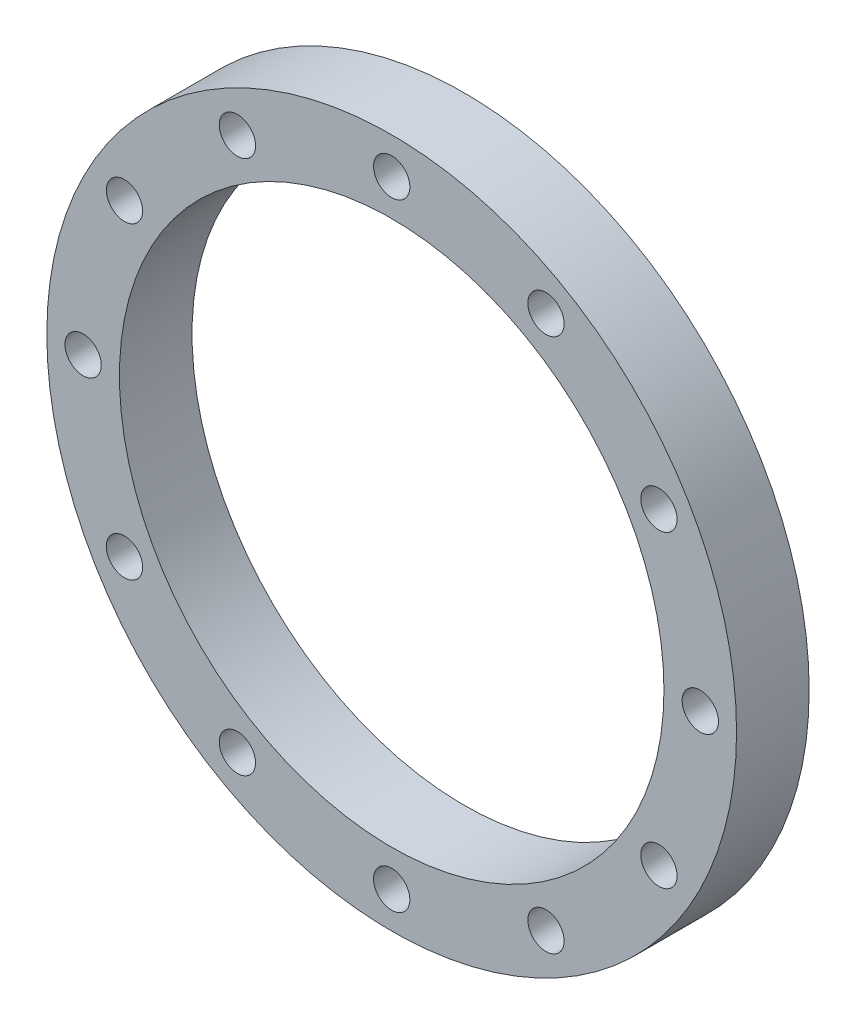
ISO-10303-21;
HEADER;
FILE_DESCRIPTION(('STEP AP214'),'2;1');
FILE_NAME('part.step','',(''),(''),'','','');
FILE_SCHEMA(('AUTOMOTIVE_DESIGN { 1 0 10303 214 1 1 1 1 }'));
ENDSEC;
DATA;
#1=APPLICATION_CONTEXT('core data for automotive mechanical design processes');
#2=APPLICATION_PROTOCOL_DEFINITION('international standard','automotive_design',2000,#1);
#3=PRODUCT_CONTEXT('',#1,'mechanical');
#4=PRODUCT('Part','Part','',(#3));
#5=PRODUCT_RELATED_PRODUCT_CATEGORY('part','',(#4));
#6=PRODUCT_DEFINITION_FORMATION('','',#4);
#7=PRODUCT_DEFINITION_CONTEXT('part definition',#1,'design');
#8=PRODUCT_DEFINITION('design','',#6,#7);
#9=PRODUCT_DEFINITION_SHAPE('','',#8);
#10=(LENGTH_UNIT() NAMED_UNIT(*) SI_UNIT(.MILLI.,.METRE.));
#11=(NAMED_UNIT(*) PLANE_ANGLE_UNIT() SI_UNIT($,.RADIAN.));
#12=(NAMED_UNIT(*) SI_UNIT($,.STERADIAN.) SOLID_ANGLE_UNIT());
#13=UNCERTAINTY_MEASURE_WITH_UNIT(LENGTH_MEASURE(1.E-05),#10,'distance_accuracy_value','');
#14=(GEOMETRIC_REPRESENTATION_CONTEXT(3) GLOBAL_UNCERTAINTY_ASSIGNED_CONTEXT((#13)) GLOBAL_UNIT_ASSIGNED_CONTEXT((#10,
#11,#12)) REPRESENTATION_CONTEXT('',''));
#15=CARTESIAN_POINT('',(0.,0.,0.));
#16=DIRECTION('',(0.,0.,1.));
#17=DIRECTION('',(1.,0.,0.));
#18=AXIS2_PLACEMENT_3D('',#15,#16,#17);
#19=CARTESIAN_POINT('',(0.,0.,25.4));
#20=DIRECTION('',(0.,0.,1.));
#21=DIRECTION('',(1.,0.,0.));
#22=AXIS2_PLACEMENT_3D('',#19,#20,#21);
#23=PLANE('',#22);
#24=CARTESIAN_POINT('',(186.974884677062,-107.949999999998,25.4));
#25=DIRECTION('',(0.,0.,1.));
#26=DIRECTION('',(1.,0.,0.));
#27=AXIS2_PLACEMENT_3D('',#24,#25,#26);
#28=CIRCLE('',#27,12.7);
#29=CARTESIAN_POINT('',(199.674884677062,-107.949999999998,25.4));
#30=VERTEX_POINT('',#29);
#31=EDGE_CURVE('E153',#30,#30,#28,.T.);
#32=ORIENTED_EDGE('',*,*,#31,.F.);
#33=EDGE_LOOP('',(#32));
#34=FACE_BOUND('',#33,.T.);
#35=CARTESIAN_POINT('',(107.950000000002,-186.974884677059,25.4));
#36=DIRECTION('',(0.,0.,1.));
#37=DIRECTION('',(1.,0.,0.));
#38=AXIS2_PLACEMENT_3D('',#35,#36,#37);
#39=CIRCLE('',#38,12.7);
#40=CARTESIAN_POINT('',(120.650000000002,-186.974884677059,25.4));
#41=VERTEX_POINT('',#40);
#42=EDGE_CURVE('E145',#41,#41,#39,.T.);
#43=ORIENTED_EDGE('',*,*,#42,.F.);
#44=EDGE_LOOP('',(#43));
#45=FACE_BOUND('',#44,.T.);
#46=CARTESIAN_POINT('',(2.2614324631687E-12,-215.9,25.4));
#47=DIRECTION('',(0.,0.,1.));
#48=DIRECTION('',(1.,0.,0.));
#49=AXIS2_PLACEMENT_3D('',#46,#47,#48);
#50=CIRCLE('',#49,12.7);
#51=CARTESIAN_POINT('',(12.7000000000022,-215.9,25.4));
#52=VERTEX_POINT('',#51);
#53=EDGE_CURVE('E137',#52,#52,#50,.T.);
#54=ORIENTED_EDGE('',*,*,#53,.F.);
#55=EDGE_LOOP('',(#54));
#56=FACE_BOUND('',#55,.T.);
#57=CARTESIAN_POINT('',(-107.949999999998,-186.974884677061,25.4));
#58=DIRECTION('',(0.,0.,1.));
#59=DIRECTION('',(1.,0.,0.));
#60=AXIS2_PLACEMENT_3D('',#57,#58,#59);
#61=CIRCLE('',#60,12.7);
#62=CARTESIAN_POINT('',(-95.2499999999983,-186.974884677061,25.4));
#63=VERTEX_POINT('',#62);
#64=EDGE_CURVE('E129',#63,#63,#61,.T.);
#65=ORIENTED_EDGE('',*,*,#64,.F.);
#66=EDGE_LOOP('',(#65));
#67=FACE_BOUND('',#66,.T.);
#68=CARTESIAN_POINT('',(-186.974884677059,-107.950000000002,25.4));
#69=DIRECTION('',(0.,0.,1.));
#70=DIRECTION('',(1.,0.,0.));
#71=AXIS2_PLACEMENT_3D('',#68,#69,#70);
#72=CIRCLE('',#71,12.7);
#73=CARTESIAN_POINT('',(-174.274884677059,-107.950000000002,25.4));
#74=VERTEX_POINT('',#73);
#75=EDGE_CURVE('E121',#74,#74,#72,.T.);
#76=ORIENTED_EDGE('',*,*,#75,.F.);
#77=EDGE_LOOP('',(#76));
#78=FACE_BOUND('',#77,.T.);
#79=CARTESIAN_POINT('',(-215.9,0.,25.4));
#80=DIRECTION('',(0.,0.,1.));
#81=DIRECTION('',(1.,0.,0.));
#82=AXIS2_PLACEMENT_3D('',#79,#80,#81);
#83=CIRCLE('',#82,12.7);
#84=CARTESIAN_POINT('',(-203.2,0.,25.4));
#85=VERTEX_POINT('',#84);
#86=EDGE_CURVE('E113',#85,#85,#83,.T.);
#87=ORIENTED_EDGE('',*,*,#86,.F.);
#88=EDGE_LOOP('',(#87));
#89=FACE_BOUND('',#88,.T.);
#90=CARTESIAN_POINT('',(-186.974884677061,107.949999999999,25.4));
#91=DIRECTION('',(0.,0.,1.));
#92=DIRECTION('',(1.,0.,0.));
#93=AXIS2_PLACEMENT_3D('',#90,#91,#92);
#94=CIRCLE('',#93,12.7);
#95=CARTESIAN_POINT('',(-174.274884677061,107.949999999999,25.4));
#96=VERTEX_POINT('',#95);
#97=EDGE_CURVE('E105',#96,#96,#94,.T.);
#98=ORIENTED_EDGE('',*,*,#97,.F.);
#99=EDGE_LOOP('',(#98));
#100=FACE_BOUND('',#99,.T.);
#101=CARTESIAN_POINT('',(-107.950000000001,186.97488467706,25.4));
#102=DIRECTION('',(0.,0.,1.));
#103=DIRECTION('',(1.,0.,0.));
#104=AXIS2_PLACEMENT_3D('',#101,#102,#103);
#105=CIRCLE('',#104,12.7);
#106=CARTESIAN_POINT('',(-95.2500000000009,186.97488467706,25.4));
#107=VERTEX_POINT('',#106);
#108=EDGE_CURVE('E97',#107,#107,#105,.T.);
#109=ORIENTED_EDGE('',*,*,#108,.F.);
#110=EDGE_LOOP('',(#109));
#111=FACE_BOUND('',#110,.T.);
#112=CARTESIAN_POINT('',(-7.53810821056232E-13,215.9,25.4));
#113=DIRECTION('',(0.,0.,1.));
#114=DIRECTION('',(1.,0.,0.));
#115=AXIS2_PLACEMENT_3D('',#112,#113,#114);
#116=CIRCLE('',#115,12.7);
#117=CARTESIAN_POINT('',(12.6999999999992,215.9,25.4));
#118=VERTEX_POINT('',#117);
#119=EDGE_CURVE('E89',#118,#118,#116,.T.);
#120=ORIENTED_EDGE('',*,*,#119,.F.);
#121=EDGE_LOOP('',(#120));
#122=FACE_BOUND('',#121,.T.);
#123=CARTESIAN_POINT('',(107.95,186.974884677061,25.4));
#124=DIRECTION('',(0.,0.,1.));
#125=DIRECTION('',(1.,0.,0.));
#126=AXIS2_PLACEMENT_3D('',#123,#124,#125);
#127=CIRCLE('',#126,12.7);
#128=CARTESIAN_POINT('',(120.65,186.974884677061,25.4));
#129=VERTEX_POINT('',#128);
#130=EDGE_CURVE('E81',#129,#129,#127,.T.);
#131=ORIENTED_EDGE('',*,*,#130,.F.);
#132=EDGE_LOOP('',(#131));
#133=FACE_BOUND('',#132,.T.);
#134=CARTESIAN_POINT('',(186.97488467706,107.95,25.4));
#135=DIRECTION('',(0.,0.,1.));
#136=DIRECTION('',(1.,0.,0.));
#137=AXIS2_PLACEMENT_3D('',#134,#135,#136);
#138=CIRCLE('',#137,12.7);
#139=CARTESIAN_POINT('',(199.67488467706,107.95,25.4));
#140=VERTEX_POINT('',#139);
#141=EDGE_CURVE('E73',#140,#140,#138,.T.);
#142=ORIENTED_EDGE('',*,*,#141,.F.);
#143=EDGE_LOOP('',(#142));
#144=FACE_BOUND('',#143,.T.);
#145=CARTESIAN_POINT('',(215.9,0.,25.4));
#146=DIRECTION('',(0.,0.,1.));
#147=DIRECTION('',(1.,0.,0.));
#148=AXIS2_PLACEMENT_3D('',#145,#146,#147);
#149=CIRCLE('',#148,12.7);
#150=CARTESIAN_POINT('',(228.6,0.,25.4));
#151=VERTEX_POINT('',#150);
#152=EDGE_CURVE('E65',#151,#151,#149,.T.);
#153=ORIENTED_EDGE('',*,*,#152,.F.);
#154=EDGE_LOOP('',(#153));
#155=FACE_BOUND('',#154,.T.);
#156=CARTESIAN_POINT('',(0.,0.,25.4));
#157=DIRECTION('',(0.,0.,1.));
#158=DIRECTION('',(1.,0.,0.));
#159=AXIS2_PLACEMENT_3D('',#156,#157,#158);
#160=CIRCLE('',#159,241.3);
#161=CARTESIAN_POINT('',(241.3,0.,25.4));
#162=VERTEX_POINT('',#161);
#163=EDGE_CURVE('E10',#162,#162,#160,.T.);
#164=ORIENTED_EDGE('',*,*,#163,.T.);
#165=EDGE_LOOP('',(#164));
#166=FACE_BOUND('',#165,.T.);
#167=CARTESIAN_POINT('',(0.,0.,25.4));
#168=DIRECTION('',(0.,0.,1.));
#169=DIRECTION('',(1.,0.,0.));
#170=AXIS2_PLACEMENT_3D('',#167,#168,#169);
#171=CIRCLE('',#170,190.5);
#172=CARTESIAN_POINT('',(190.5,0.,25.4));
#173=VERTEX_POINT('',#172);
#174=EDGE_CURVE('E52',#173,#173,#171,.T.);
#175=ORIENTED_EDGE('',*,*,#174,.F.);
#176=EDGE_LOOP('',(#175));
#177=FACE_BOUND('',#176,.T.);
#178=ADVANCED_FACE('F39',(#34,#45,#56,#67,#78,#89,#100,#111,#122,#133,#144,#155,#166,#177),#23,.T.);
#179=CARTESIAN_POINT('',(0.,0.,-25.4));
#180=DIRECTION('',(0.,0.,1.));
#181=DIRECTION('',(1.,0.,0.));
#182=AXIS2_PLACEMENT_3D('',#179,#180,#181);
#183=PLANE('',#182);
#184=CARTESIAN_POINT('',(186.974884677062,-107.949999999998,-25.4));
#185=DIRECTION('',(0.,0.,1.));
#186=DIRECTION('',(1.,0.,0.));
#187=AXIS2_PLACEMENT_3D('',#184,#185,#186);
#188=CIRCLE('',#187,12.7);
#189=CARTESIAN_POINT('',(199.674884677062,-107.949999999998,-25.4));
#190=VERTEX_POINT('',#189);
#191=EDGE_CURVE('E149',#190,#190,#188,.T.);
#192=ORIENTED_EDGE('',*,*,#191,.T.);
#193=EDGE_LOOP('',(#192));
#194=FACE_BOUND('',#193,.T.);
#195=CARTESIAN_POINT('',(107.950000000002,-186.974884677059,-25.4));
#196=DIRECTION('',(0.,0.,1.));
#197=DIRECTION('',(1.,0.,0.));
#198=AXIS2_PLACEMENT_3D('',#195,#196,#197);
#199=CIRCLE('',#198,12.7);
#200=CARTESIAN_POINT('',(120.650000000002,-186.974884677059,-25.4));
#201=VERTEX_POINT('',#200);
#202=EDGE_CURVE('E141',#201,#201,#199,.T.);
#203=ORIENTED_EDGE('',*,*,#202,.T.);
#204=EDGE_LOOP('',(#203));
#205=FACE_BOUND('',#204,.T.);
#206=CARTESIAN_POINT('',(2.2614324631687E-12,-215.9,-25.4));
#207=DIRECTION('',(0.,0.,1.));
#208=DIRECTION('',(1.,0.,0.));
#209=AXIS2_PLACEMENT_3D('',#206,#207,#208);
#210=CIRCLE('',#209,12.7);
#211=CARTESIAN_POINT('',(12.7000000000022,-215.9,-25.4));
#212=VERTEX_POINT('',#211);
#213=EDGE_CURVE('E133',#212,#212,#210,.T.);
#214=ORIENTED_EDGE('',*,*,#213,.T.);
#215=EDGE_LOOP('',(#214));
#216=FACE_BOUND('',#215,.T.);
#217=CARTESIAN_POINT('',(-107.949999999998,-186.974884677061,-25.4));
#218=DIRECTION('',(0.,0.,1.));
#219=DIRECTION('',(1.,0.,0.));
#220=AXIS2_PLACEMENT_3D('',#217,#218,#219);
#221=CIRCLE('',#220,12.7);
#222=CARTESIAN_POINT('',(-95.2499999999983,-186.974884677061,-25.4));
#223=VERTEX_POINT('',#222);
#224=EDGE_CURVE('E125',#223,#223,#221,.T.);
#225=ORIENTED_EDGE('',*,*,#224,.T.);
#226=EDGE_LOOP('',(#225));
#227=FACE_BOUND('',#226,.T.);
#228=CARTESIAN_POINT('',(-186.974884677059,-107.950000000002,-25.4));
#229=DIRECTION('',(0.,0.,1.));
#230=DIRECTION('',(1.,0.,0.));
#231=AXIS2_PLACEMENT_3D('',#228,#229,#230);
#232=CIRCLE('',#231,12.7);
#233=CARTESIAN_POINT('',(-174.274884677059,-107.950000000002,-25.4));
#234=VERTEX_POINT('',#233);
#235=EDGE_CURVE('E117',#234,#234,#232,.T.);
#236=ORIENTED_EDGE('',*,*,#235,.T.);
#237=EDGE_LOOP('',(#236));
#238=FACE_BOUND('',#237,.T.);
#239=CARTESIAN_POINT('',(-215.9,0.,-25.4));
#240=DIRECTION('',(0.,0.,1.));
#241=DIRECTION('',(1.,0.,0.));
#242=AXIS2_PLACEMENT_3D('',#239,#240,#241);
#243=CIRCLE('',#242,12.7);
#244=CARTESIAN_POINT('',(-203.2,0.,-25.4));
#245=VERTEX_POINT('',#244);
#246=EDGE_CURVE('E109',#245,#245,#243,.T.);
#247=ORIENTED_EDGE('',*,*,#246,.T.);
#248=EDGE_LOOP('',(#247));
#249=FACE_BOUND('',#248,.T.);
#250=CARTESIAN_POINT('',(-186.974884677061,107.949999999999,-25.4));
#251=DIRECTION('',(0.,0.,1.));
#252=DIRECTION('',(1.,0.,0.));
#253=AXIS2_PLACEMENT_3D('',#250,#251,#252);
#254=CIRCLE('',#253,12.7);
#255=CARTESIAN_POINT('',(-174.274884677061,107.949999999999,-25.4));
#256=VERTEX_POINT('',#255);
#257=EDGE_CURVE('E101',#256,#256,#254,.T.);
#258=ORIENTED_EDGE('',*,*,#257,.T.);
#259=EDGE_LOOP('',(#258));
#260=FACE_BOUND('',#259,.T.);
#261=CARTESIAN_POINT('',(-107.950000000001,186.97488467706,-25.4));
#262=DIRECTION('',(0.,0.,1.));
#263=DIRECTION('',(1.,0.,0.));
#264=AXIS2_PLACEMENT_3D('',#261,#262,#263);
#265=CIRCLE('',#264,12.7);
#266=CARTESIAN_POINT('',(-95.2500000000009,186.97488467706,-25.4));
#267=VERTEX_POINT('',#266);
#268=EDGE_CURVE('E93',#267,#267,#265,.T.);
#269=ORIENTED_EDGE('',*,*,#268,.T.);
#270=EDGE_LOOP('',(#269));
#271=FACE_BOUND('',#270,.T.);
#272=CARTESIAN_POINT('',(-7.53810821056232E-13,215.9,-25.4));
#273=DIRECTION('',(0.,0.,1.));
#274=DIRECTION('',(1.,0.,0.));
#275=AXIS2_PLACEMENT_3D('',#272,#273,#274);
#276=CIRCLE('',#275,12.7);
#277=CARTESIAN_POINT('',(12.6999999999992,215.9,-25.4));
#278=VERTEX_POINT('',#277);
#279=EDGE_CURVE('E85',#278,#278,#276,.T.);
#280=ORIENTED_EDGE('',*,*,#279,.T.);
#281=EDGE_LOOP('',(#280));
#282=FACE_BOUND('',#281,.T.);
#283=CARTESIAN_POINT('',(107.95,186.974884677061,-25.4));
#284=DIRECTION('',(0.,0.,1.));
#285=DIRECTION('',(1.,0.,0.));
#286=AXIS2_PLACEMENT_3D('',#283,#284,#285);
#287=CIRCLE('',#286,12.7);
#288=CARTESIAN_POINT('',(120.65,186.974884677061,-25.4));
#289=VERTEX_POINT('',#288);
#290=EDGE_CURVE('E77',#289,#289,#287,.T.);
#291=ORIENTED_EDGE('',*,*,#290,.T.);
#292=EDGE_LOOP('',(#291));
#293=FACE_BOUND('',#292,.T.);
#294=CARTESIAN_POINT('',(186.97488467706,107.95,-25.4));
#295=DIRECTION('',(0.,0.,1.));
#296=DIRECTION('',(1.,0.,0.));
#297=AXIS2_PLACEMENT_3D('',#294,#295,#296);
#298=CIRCLE('',#297,12.7);
#299=CARTESIAN_POINT('',(199.67488467706,107.95,-25.4));
#300=VERTEX_POINT('',#299);
#301=EDGE_CURVE('E69',#300,#300,#298,.T.);
#302=ORIENTED_EDGE('',*,*,#301,.T.);
#303=EDGE_LOOP('',(#302));
#304=FACE_BOUND('',#303,.T.);
#305=CARTESIAN_POINT('',(215.9,0.,-25.4));
#306=DIRECTION('',(0.,0.,1.));
#307=DIRECTION('',(1.,0.,0.));
#308=AXIS2_PLACEMENT_3D('',#305,#306,#307);
#309=CIRCLE('',#308,12.7);
#310=CARTESIAN_POINT('',(228.6,0.,-25.4));
#311=VERTEX_POINT('',#310);
#312=EDGE_CURVE('E58',#311,#311,#309,.T.);
#313=ORIENTED_EDGE('',*,*,#312,.T.);
#314=EDGE_LOOP('',(#313));
#315=FACE_BOUND('',#314,.T.);
#316=CARTESIAN_POINT('',(0.,0.,-25.4));
#317=DIRECTION('',(0.,0.,1.));
#318=DIRECTION('',(1.,0.,0.));
#319=AXIS2_PLACEMENT_3D('',#316,#317,#318);
#320=CIRCLE('',#319,241.3);
#321=CARTESIAN_POINT('',(241.3,0.,-25.4));
#322=VERTEX_POINT('',#321);
#323=EDGE_CURVE('E43',#322,#322,#320,.T.);
#324=ORIENTED_EDGE('',*,*,#323,.F.);
#325=EDGE_LOOP('',(#324));
#326=FACE_BOUND('',#325,.T.);
#327=CARTESIAN_POINT('',(0.,0.,-25.4));
#328=DIRECTION('',(0.,0.,1.));
#329=DIRECTION('',(1.,0.,0.));
#330=AXIS2_PLACEMENT_3D('',#327,#328,#329);
#331=CIRCLE('',#330,190.5);
#332=CARTESIAN_POINT('',(190.5,0.,-25.4));
#333=VERTEX_POINT('',#332);
#334=EDGE_CURVE('E54',#333,#333,#331,.T.);
#335=ORIENTED_EDGE('',*,*,#334,.T.);
#336=EDGE_LOOP('',(#335));
#337=FACE_BOUND('',#336,.T.);
#338=ADVANCED_FACE('F162',(#194,#205,#216,#227,#238,#249,#260,#271,#282,#293,#304,#315,#326,
#337),#183,.F.);
#339=CARTESIAN_POINT('',(0.,0.,25.4));
#340=DIRECTION('',(0.,0.,-1.));
#341=DIRECTION('',(-1.,0.,0.));
#342=AXIS2_PLACEMENT_3D('',#339,#340,#341);
#343=CYLINDRICAL_SURFACE('',#342,241.3);
#344=ORIENTED_EDGE('',*,*,#163,.F.);
#345=EDGE_LOOP('',(#344));
#346=FACE_BOUND('',#345,.T.);
#347=ORIENTED_EDGE('',*,*,#323,.T.);
#348=EDGE_LOOP('',(#347));
#349=FACE_BOUND('',#348,.T.);
#350=ADVANCED_FACE('F41',(#346,#349),#343,.T.);
#351=CARTESIAN_POINT('',(0.,0.,25.4));
#352=DIRECTION('',(0.,0.,-1.));
#353=DIRECTION('',(-1.,0.,0.));
#354=AXIS2_PLACEMENT_3D('',#351,#352,#353);
#355=CYLINDRICAL_SURFACE('',#354,190.5);
#356=ORIENTED_EDGE('',*,*,#174,.T.);
#357=EDGE_LOOP('',(#356));
#358=FACE_BOUND('',#357,.T.);
#359=ORIENTED_EDGE('',*,*,#334,.F.);
#360=EDGE_LOOP('',(#359));
#361=FACE_BOUND('',#360,.T.);
#362=ADVANCED_FACE('F188',(#358,#361),#355,.F.);
#363=CARTESIAN_POINT('',(215.9,0.,25.4));
#364=DIRECTION('',(0.,0.,1.));
#365=DIRECTION('',(1.,0.,0.));
#366=AXIS2_PLACEMENT_3D('',#363,#364,#365);
#367=CYLINDRICAL_SURFACE('',#366,12.7);
#368=ORIENTED_EDGE('',*,*,#312,.F.);
#369=EDGE_LOOP('',(#368));
#370=FACE_BOUND('',#369,.T.);
#371=ORIENTED_EDGE('',*,*,#152,.T.);
#372=EDGE_LOOP('',(#371));
#373=FACE_BOUND('',#372,.T.);
#374=ADVANCED_FACE('F191',(#370,#373),#367,.F.);
#375=CARTESIAN_POINT('',(186.97488467706,107.95,25.4));
#376=DIRECTION('',(0.,0.,1.));
#377=DIRECTION('',(1.,0.,0.));
#378=AXIS2_PLACEMENT_3D('',#375,#376,#377);
#379=CYLINDRICAL_SURFACE('',#378,12.7);
#380=ORIENTED_EDGE('',*,*,#301,.F.);
#381=EDGE_LOOP('',(#380));
#382=FACE_BOUND('',#381,.T.);
#383=ORIENTED_EDGE('',*,*,#141,.T.);
#384=EDGE_LOOP('',(#383));
#385=FACE_BOUND('',#384,.T.);
#386=ADVANCED_FACE('F205',(#382,#385),#379,.F.);
#387=CARTESIAN_POINT('',(107.95,186.974884677061,25.4));
#388=DIRECTION('',(0.,0.,1.));
#389=DIRECTION('',(1.,0.,0.));
#390=AXIS2_PLACEMENT_3D('',#387,#388,#389);
#391=CYLINDRICAL_SURFACE('',#390,12.7);
#392=ORIENTED_EDGE('',*,*,#290,.F.);
#393=EDGE_LOOP('',(#392));
#394=FACE_BOUND('',#393,.T.);
#395=ORIENTED_EDGE('',*,*,#130,.T.);
#396=EDGE_LOOP('',(#395));
#397=FACE_BOUND('',#396,.T.);
#398=ADVANCED_FACE('F209',(#394,#397),#391,.F.);
#399=CARTESIAN_POINT('',(-7.53810821056232E-13,215.9,25.4));
#400=DIRECTION('',(0.,0.,1.));
#401=DIRECTION('',(1.,0.,0.));
#402=AXIS2_PLACEMENT_3D('',#399,#400,#401);
#403=CYLINDRICAL_SURFACE('',#402,12.7);
#404=ORIENTED_EDGE('',*,*,#279,.F.);
#405=EDGE_LOOP('',(#404));
#406=FACE_BOUND('',#405,.T.);
#407=ORIENTED_EDGE('',*,*,#119,.T.);
#408=EDGE_LOOP('',(#407));
#409=FACE_BOUND('',#408,.T.);
#410=ADVANCED_FACE('F213',(#406,#409),#403,.F.);
#411=CARTESIAN_POINT('',(-107.950000000001,186.97488467706,25.4));
#412=DIRECTION('',(0.,0.,1.));
#413=DIRECTION('',(1.,0.,0.));
#414=AXIS2_PLACEMENT_3D('',#411,#412,#413);
#415=CYLINDRICAL_SURFACE('',#414,12.7);
#416=ORIENTED_EDGE('',*,*,#268,.F.);
#417=EDGE_LOOP('',(#416));
#418=FACE_BOUND('',#417,.T.);
#419=ORIENTED_EDGE('',*,*,#108,.T.);
#420=EDGE_LOOP('',(#419));
#421=FACE_BOUND('',#420,.T.);
#422=ADVANCED_FACE('F217',(#418,#421),#415,.F.);
#423=CARTESIAN_POINT('',(-186.974884677061,107.949999999999,25.4));
#424=DIRECTION('',(0.,0.,1.));
#425=DIRECTION('',(1.,0.,0.));
#426=AXIS2_PLACEMENT_3D('',#423,#424,#425);
#427=CYLINDRICAL_SURFACE('',#426,12.7);
#428=ORIENTED_EDGE('',*,*,#257,.F.);
#429=EDGE_LOOP('',(#428));
#430=FACE_BOUND('',#429,.T.);
#431=ORIENTED_EDGE('',*,*,#97,.T.);
#432=EDGE_LOOP('',(#431));
#433=FACE_BOUND('',#432,.T.);
#434=ADVANCED_FACE('F221',(#430,#433),#427,.F.);
#435=CARTESIAN_POINT('',(-215.9,0.,25.4));
#436=DIRECTION('',(0.,0.,1.));
#437=DIRECTION('',(1.,0.,0.));
#438=AXIS2_PLACEMENT_3D('',#435,#436,#437);
#439=CYLINDRICAL_SURFACE('',#438,12.7);
#440=ORIENTED_EDGE('',*,*,#246,.F.);
#441=EDGE_LOOP('',(#440));
#442=FACE_BOUND('',#441,.T.);
#443=ORIENTED_EDGE('',*,*,#86,.T.);
#444=EDGE_LOOP('',(#443));
#445=FACE_BOUND('',#444,.T.);
#446=ADVANCED_FACE('F225',(#442,#445),#439,.F.);
#447=CARTESIAN_POINT('',(-186.974884677059,-107.950000000002,25.4));
#448=DIRECTION('',(0.,0.,1.));
#449=DIRECTION('',(1.,0.,0.));
#450=AXIS2_PLACEMENT_3D('',#447,#448,#449);
#451=CYLINDRICAL_SURFACE('',#450,12.7);
#452=ORIENTED_EDGE('',*,*,#235,.F.);
#453=EDGE_LOOP('',(#452));
#454=FACE_BOUND('',#453,.T.);
#455=ORIENTED_EDGE('',*,*,#75,.T.);
#456=EDGE_LOOP('',(#455));
#457=FACE_BOUND('',#456,.T.);
#458=ADVANCED_FACE('F229',(#454,#457),#451,.F.);
#459=CARTESIAN_POINT('',(-107.949999999998,-186.974884677061,25.4));
#460=DIRECTION('',(0.,0.,1.));
#461=DIRECTION('',(1.,0.,0.));
#462=AXIS2_PLACEMENT_3D('',#459,#460,#461);
#463=CYLINDRICAL_SURFACE('',#462,12.7);
#464=ORIENTED_EDGE('',*,*,#224,.F.);
#465=EDGE_LOOP('',(#464));
#466=FACE_BOUND('',#465,.T.);
#467=ORIENTED_EDGE('',*,*,#64,.T.);
#468=EDGE_LOOP('',(#467));
#469=FACE_BOUND('',#468,.T.);
#470=ADVANCED_FACE('F233',(#466,#469),#463,.F.);
#471=CARTESIAN_POINT('',(2.2614324631687E-12,-215.9,25.4));
#472=DIRECTION('',(0.,0.,1.));
#473=DIRECTION('',(1.,0.,0.));
#474=AXIS2_PLACEMENT_3D('',#471,#472,#473);
#475=CYLINDRICAL_SURFACE('',#474,12.7);
#476=ORIENTED_EDGE('',*,*,#213,.F.);
#477=EDGE_LOOP('',(#476));
#478=FACE_BOUND('',#477,.T.);
#479=ORIENTED_EDGE('',*,*,#53,.T.);
#480=EDGE_LOOP('',(#479));
#481=FACE_BOUND('',#480,.T.);
#482=ADVANCED_FACE('F237',(#478,#481),#475,.F.);
#483=CARTESIAN_POINT('',(107.950000000002,-186.974884677059,25.4));
#484=DIRECTION('',(0.,0.,1.));
#485=DIRECTION('',(1.,0.,0.));
#486=AXIS2_PLACEMENT_3D('',#483,#484,#485);
#487=CYLINDRICAL_SURFACE('',#486,12.7);
#488=ORIENTED_EDGE('',*,*,#202,.F.);
#489=EDGE_LOOP('',(#488));
#490=FACE_BOUND('',#489,.T.);
#491=ORIENTED_EDGE('',*,*,#42,.T.);
#492=EDGE_LOOP('',(#491));
#493=FACE_BOUND('',#492,.T.);
#494=ADVANCED_FACE('F241',(#490,#493),#487,.F.);
#495=CARTESIAN_POINT('',(186.974884677062,-107.949999999998,25.4));
#496=DIRECTION('',(0.,0.,1.));
#497=DIRECTION('',(1.,0.,0.));
#498=AXIS2_PLACEMENT_3D('',#495,#496,#497);
#499=CYLINDRICAL_SURFACE('',#498,12.7);
#500=ORIENTED_EDGE('',*,*,#191,.F.);
#501=EDGE_LOOP('',(#500));
#502=FACE_BOUND('',#501,.T.);
#503=ORIENTED_EDGE('',*,*,#31,.T.);
#504=EDGE_LOOP('',(#503));
#505=FACE_BOUND('',#504,.T.);
#506=ADVANCED_FACE('F158',(#502,#505),#499,.F.);
#507=CLOSED_SHELL('',(#178,#338,#350,#362,#374,#386,#398,#410,#422,#434,#446,#458,#470,#482,
#494,#506));
#508=MANIFOLD_SOLID_BREP('B2',#507);
#509=ADVANCED_BREP_SHAPE_REPRESENTATION('',(#18,#508),#14);
#510=SHAPE_DEFINITION_REPRESENTATION(#9,#509);
ENDSEC;
END-ISO-10303-21;
